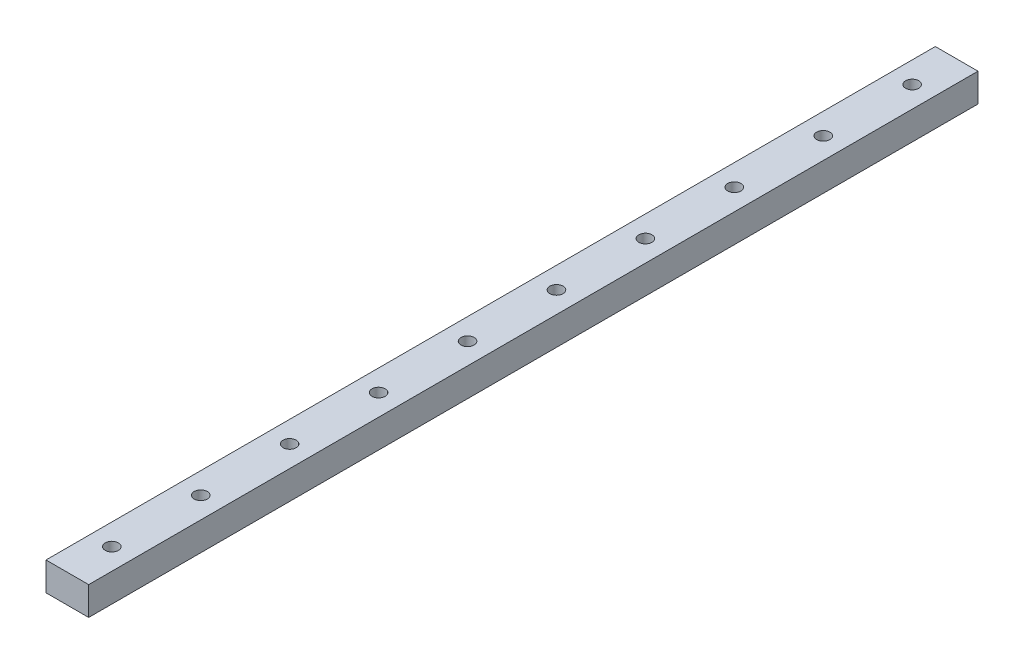
ISO-10303-21;
HEADER;
FILE_DESCRIPTION(('STEP AP214'),'2;1');
FILE_NAME('part.step','',(''),(''),'','','');
FILE_SCHEMA(('AUTOMOTIVE_DESIGN { 1 0 10303 214 1 1 1 1 }'));
ENDSEC;
DATA;
#1=APPLICATION_CONTEXT('core data for automotive mechanical design processes');
#2=APPLICATION_PROTOCOL_DEFINITION('international standard','automotive_design',2000,#1);
#3=PRODUCT_CONTEXT('',#1,'mechanical');
#4=PRODUCT('Part','Part','',(#3));
#5=PRODUCT_RELATED_PRODUCT_CATEGORY('part','',(#4));
#6=PRODUCT_DEFINITION_FORMATION('','',#4);
#7=PRODUCT_DEFINITION_CONTEXT('part definition',#1,'design');
#8=PRODUCT_DEFINITION('design','',#6,#7);
#9=PRODUCT_DEFINITION_SHAPE('','',#8);
#10=(LENGTH_UNIT() NAMED_UNIT(*) SI_UNIT(.MILLI.,.METRE.));
#11=(NAMED_UNIT(*) PLANE_ANGLE_UNIT() SI_UNIT($,.RADIAN.));
#12=(NAMED_UNIT(*) SI_UNIT($,.STERADIAN.) SOLID_ANGLE_UNIT());
#13=UNCERTAINTY_MEASURE_WITH_UNIT(LENGTH_MEASURE(1.E-05),#10,'distance_accuracy_value','');
#14=(GEOMETRIC_REPRESENTATION_CONTEXT(3) GLOBAL_UNCERTAINTY_ASSIGNED_CONTEXT((#13)) GLOBAL_UNIT_ASSIGNED_CONTEXT((#10,
#11,#12)) REPRESENTATION_CONTEXT('',''));
#15=CARTESIAN_POINT('',(0.,0.,0.));
#16=DIRECTION('',(0.,0.,1.));
#17=DIRECTION('',(1.,0.,0.));
#18=AXIS2_PLACEMENT_3D('',#15,#16,#17);
#19=CARTESIAN_POINT('',(6.,0.,12.5));
#20=DIRECTION('',(0.,1.,0.));
#21=DIRECTION('',(0.,0.,1.));
#22=AXIS2_PLACEMENT_3D('',#19,#20,#21);
#23=CYLINDRICAL_SURFACE('',#22,1.85);
#24=CARTESIAN_POINT('',(6.,0.,12.5));
#25=DIRECTION('',(0.,1.,0.));
#26=DIRECTION('',(0.,0.,1.));
#27=AXIS2_PLACEMENT_3D('',#24,#25,#26);
#28=CIRCLE('',#27,1.85);
#29=CARTESIAN_POINT('',(6.,0.,14.35));
#30=VERTEX_POINT('',#29);
#31=EDGE_CURVE('E47',#30,#30,#28,.T.);
#32=ORIENTED_EDGE('',*,*,#31,.F.);
#33=EDGE_LOOP('',(#32));
#34=FACE_BOUND('',#33,.T.);
#35=CARTESIAN_POINT('',(6.,8.,12.5));
#36=DIRECTION('',(0.,1.,0.));
#37=DIRECTION('',(0.,0.,1.));
#38=AXIS2_PLACEMENT_3D('',#35,#36,#37);
#39=CIRCLE('',#38,1.85);
#40=CARTESIAN_POINT('',(6.,8.,14.35));
#41=VERTEX_POINT('',#40);
#42=EDGE_CURVE('E11',#41,#41,#39,.T.);
#43=ORIENTED_EDGE('',*,*,#42,.T.);
#44=EDGE_LOOP('',(#43));
#45=FACE_BOUND('',#44,.T.);
#46=ADVANCED_FACE('F39',(#34,#45),#23,.F.);
#47=CARTESIAN_POINT('',(6.,0.,37.5));
#48=DIRECTION('',(0.,1.,0.));
#49=DIRECTION('',(0.,0.,1.));
#50=AXIS2_PLACEMENT_3D('',#47,#48,#49);
#51=CYLINDRICAL_SURFACE('',#50,1.85);
#52=CARTESIAN_POINT('',(6.,0.,37.5));
#53=DIRECTION('',(0.,1.,0.));
#54=DIRECTION('',(0.,0.,1.));
#55=AXIS2_PLACEMENT_3D('',#52,#53,#54);
#56=CIRCLE('',#55,1.85);
#57=CARTESIAN_POINT('',(6.,0.,39.35));
#58=VERTEX_POINT('',#57);
#59=EDGE_CURVE('E153',#58,#58,#56,.T.);
#60=ORIENTED_EDGE('',*,*,#59,.F.);
#61=EDGE_LOOP('',(#60));
#62=FACE_BOUND('',#61,.T.);
#63=CARTESIAN_POINT('',(6.,8.,37.5));
#64=DIRECTION('',(0.,1.,0.));
#65=DIRECTION('',(0.,0.,1.));
#66=AXIS2_PLACEMENT_3D('',#63,#64,#65);
#67=CIRCLE('',#66,1.85);
#68=CARTESIAN_POINT('',(6.,8.,39.35));
#69=VERTEX_POINT('',#68);
#70=EDGE_CURVE('E156',#69,#69,#67,.T.);
#71=ORIENTED_EDGE('',*,*,#70,.T.);
#72=EDGE_LOOP('',(#71));
#73=FACE_BOUND('',#72,.T.);
#74=ADVANCED_FACE('F164',(#62,#73),#51,.F.);
#75=CARTESIAN_POINT('',(6.,0.,62.5));
#76=DIRECTION('',(0.,1.,0.));
#77=DIRECTION('',(0.,0.,1.));
#78=AXIS2_PLACEMENT_3D('',#75,#76,#77);
#79=CYLINDRICAL_SURFACE('',#78,1.85);
#80=CARTESIAN_POINT('',(6.,0.,62.5));
#81=DIRECTION('',(0.,1.,0.));
#82=DIRECTION('',(0.,0.,1.));
#83=AXIS2_PLACEMENT_3D('',#80,#81,#82);
#84=CIRCLE('',#83,1.85);
#85=CARTESIAN_POINT('',(6.,0.,64.35));
#86=VERTEX_POINT('',#85);
#87=EDGE_CURVE('E147',#86,#86,#84,.T.);
#88=ORIENTED_EDGE('',*,*,#87,.F.);
#89=EDGE_LOOP('',(#88));
#90=FACE_BOUND('',#89,.T.);
#91=CARTESIAN_POINT('',(6.,8.,62.5));
#92=DIRECTION('',(0.,1.,0.));
#93=DIRECTION('',(0.,0.,1.));
#94=AXIS2_PLACEMENT_3D('',#91,#92,#93);
#95=CIRCLE('',#94,1.85);
#96=CARTESIAN_POINT('',(6.,8.,64.35));
#97=VERTEX_POINT('',#96);
#98=EDGE_CURVE('E150',#97,#97,#95,.T.);
#99=ORIENTED_EDGE('',*,*,#98,.T.);
#100=EDGE_LOOP('',(#99));
#101=FACE_BOUND('',#100,.T.);
#102=ADVANCED_FACE('F209',(#90,#101),#79,.F.);
#103=CARTESIAN_POINT('',(6.,0.,87.5));
#104=DIRECTION('',(0.,1.,0.));
#105=DIRECTION('',(0.,0.,1.));
#106=AXIS2_PLACEMENT_3D('',#103,#104,#105);
#107=CYLINDRICAL_SURFACE('',#106,1.85);
#108=CARTESIAN_POINT('',(6.,0.,87.5));
#109=DIRECTION('',(0.,1.,0.));
#110=DIRECTION('',(0.,0.,1.));
#111=AXIS2_PLACEMENT_3D('',#108,#109,#110);
#112=CIRCLE('',#111,1.85);
#113=CARTESIAN_POINT('',(6.,0.,89.35));
#114=VERTEX_POINT('',#113);
#115=EDGE_CURVE('E141',#114,#114,#112,.T.);
#116=ORIENTED_EDGE('',*,*,#115,.F.);
#117=EDGE_LOOP('',(#116));
#118=FACE_BOUND('',#117,.T.);
#119=CARTESIAN_POINT('',(6.,8.,87.5));
#120=DIRECTION('',(0.,1.,0.));
#121=DIRECTION('',(0.,0.,1.));
#122=AXIS2_PLACEMENT_3D('',#119,#120,#121);
#123=CIRCLE('',#122,1.85);
#124=CARTESIAN_POINT('',(6.,8.,89.35));
#125=VERTEX_POINT('',#124);
#126=EDGE_CURVE('E144',#125,#125,#123,.T.);
#127=ORIENTED_EDGE('',*,*,#126,.T.);
#128=EDGE_LOOP('',(#127));
#129=FACE_BOUND('',#128,.T.);
#130=ADVANCED_FACE('F205',(#118,#129),#107,.F.);
#131=CARTESIAN_POINT('',(6.,0.,112.5));
#132=DIRECTION('',(0.,1.,0.));
#133=DIRECTION('',(0.,0.,1.));
#134=AXIS2_PLACEMENT_3D('',#131,#132,#133);
#135=CYLINDRICAL_SURFACE('',#134,1.85);
#136=CARTESIAN_POINT('',(6.,0.,112.5));
#137=DIRECTION('',(0.,1.,0.));
#138=DIRECTION('',(0.,0.,1.));
#139=AXIS2_PLACEMENT_3D('',#136,#137,#138);
#140=CIRCLE('',#139,1.85);
#141=CARTESIAN_POINT('',(6.,0.,114.35));
#142=VERTEX_POINT('',#141);
#143=EDGE_CURVE('E135',#142,#142,#140,.T.);
#144=ORIENTED_EDGE('',*,*,#143,.F.);
#145=EDGE_LOOP('',(#144));
#146=FACE_BOUND('',#145,.T.);
#147=CARTESIAN_POINT('',(6.,8.,112.5));
#148=DIRECTION('',(0.,1.,0.));
#149=DIRECTION('',(0.,0.,1.));
#150=AXIS2_PLACEMENT_3D('',#147,#148,#149);
#151=CIRCLE('',#150,1.85);
#152=CARTESIAN_POINT('',(6.,8.,114.35));
#153=VERTEX_POINT('',#152);
#154=EDGE_CURVE('E138',#153,#153,#151,.T.);
#155=ORIENTED_EDGE('',*,*,#154,.T.);
#156=EDGE_LOOP('',(#155));
#157=FACE_BOUND('',#156,.T.);
#158=ADVANCED_FACE('F201',(#146,#157),#135,.F.);
#159=CARTESIAN_POINT('',(6.,0.,137.5));
#160=DIRECTION('',(0.,1.,0.));
#161=DIRECTION('',(0.,0.,1.));
#162=AXIS2_PLACEMENT_3D('',#159,#160,#161);
#163=CYLINDRICAL_SURFACE('',#162,1.85);
#164=CARTESIAN_POINT('',(6.,0.,137.5));
#165=DIRECTION('',(0.,1.,0.));
#166=DIRECTION('',(0.,0.,1.));
#167=AXIS2_PLACEMENT_3D('',#164,#165,#166);
#168=CIRCLE('',#167,1.85);
#169=CARTESIAN_POINT('',(6.,0.,139.35));
#170=VERTEX_POINT('',#169);
#171=EDGE_CURVE('E129',#170,#170,#168,.T.);
#172=ORIENTED_EDGE('',*,*,#171,.F.);
#173=EDGE_LOOP('',(#172));
#174=FACE_BOUND('',#173,.T.);
#175=CARTESIAN_POINT('',(6.,8.,137.5));
#176=DIRECTION('',(0.,1.,0.));
#177=DIRECTION('',(0.,0.,1.));
#178=AXIS2_PLACEMENT_3D('',#175,#176,#177);
#179=CIRCLE('',#178,1.85);
#180=CARTESIAN_POINT('',(6.,8.,139.35));
#181=VERTEX_POINT('',#180);
#182=EDGE_CURVE('E132',#181,#181,#179,.T.);
#183=ORIENTED_EDGE('',*,*,#182,.T.);
#184=EDGE_LOOP('',(#183));
#185=FACE_BOUND('',#184,.T.);
#186=ADVANCED_FACE('F197',(#174,#185),#163,.F.);
#187=CARTESIAN_POINT('',(6.,0.,162.5));
#188=DIRECTION('',(0.,1.,0.));
#189=DIRECTION('',(0.,0.,1.));
#190=AXIS2_PLACEMENT_3D('',#187,#188,#189);
#191=CYLINDRICAL_SURFACE('',#190,1.85);
#192=CARTESIAN_POINT('',(6.,0.,162.5));
#193=DIRECTION('',(0.,1.,0.));
#194=DIRECTION('',(0.,0.,1.));
#195=AXIS2_PLACEMENT_3D('',#192,#193,#194);
#196=CIRCLE('',#195,1.85);
#197=CARTESIAN_POINT('',(6.,0.,164.35));
#198=VERTEX_POINT('',#197);
#199=EDGE_CURVE('E123',#198,#198,#196,.T.);
#200=ORIENTED_EDGE('',*,*,#199,.F.);
#201=EDGE_LOOP('',(#200));
#202=FACE_BOUND('',#201,.T.);
#203=CARTESIAN_POINT('',(6.,8.,162.5));
#204=DIRECTION('',(0.,1.,0.));
#205=DIRECTION('',(0.,0.,1.));
#206=AXIS2_PLACEMENT_3D('',#203,#204,#205);
#207=CIRCLE('',#206,1.85);
#208=CARTESIAN_POINT('',(6.,8.,164.35));
#209=VERTEX_POINT('',#208);
#210=EDGE_CURVE('E126',#209,#209,#207,.T.);
#211=ORIENTED_EDGE('',*,*,#210,.T.);
#212=EDGE_LOOP('',(#211));
#213=FACE_BOUND('',#212,.T.);
#214=ADVANCED_FACE('F193',(#202,#213),#191,.F.);
#215=CARTESIAN_POINT('',(6.,0.,187.5));
#216=DIRECTION('',(0.,1.,0.));
#217=DIRECTION('',(0.,0.,1.));
#218=AXIS2_PLACEMENT_3D('',#215,#216,#217);
#219=CYLINDRICAL_SURFACE('',#218,1.85);
#220=CARTESIAN_POINT('',(6.,0.,187.5));
#221=DIRECTION('',(0.,1.,0.));
#222=DIRECTION('',(0.,0.,1.));
#223=AXIS2_PLACEMENT_3D('',#220,#221,#222);
#224=CIRCLE('',#223,1.85);
#225=CARTESIAN_POINT('',(6.,0.,189.35));
#226=VERTEX_POINT('',#225);
#227=EDGE_CURVE('E117',#226,#226,#224,.T.);
#228=ORIENTED_EDGE('',*,*,#227,.F.);
#229=EDGE_LOOP('',(#228));
#230=FACE_BOUND('',#229,.T.);
#231=CARTESIAN_POINT('',(6.,8.,187.5));
#232=DIRECTION('',(0.,1.,0.));
#233=DIRECTION('',(0.,0.,1.));
#234=AXIS2_PLACEMENT_3D('',#231,#232,#233);
#235=CIRCLE('',#234,1.85);
#236=CARTESIAN_POINT('',(6.,8.,189.35));
#237=VERTEX_POINT('',#236);
#238=EDGE_CURVE('E120',#237,#237,#235,.T.);
#239=ORIENTED_EDGE('',*,*,#238,.T.);
#240=EDGE_LOOP('',(#239));
#241=FACE_BOUND('',#240,.T.);
#242=ADVANCED_FACE('F189',(#230,#241),#219,.F.);
#243=CARTESIAN_POINT('',(0.,0.,250.));
#244=DIRECTION('',(1.,0.,0.));
#245=DIRECTION('',(0.,0.,-1.));
#246=AXIS2_PLACEMENT_3D('',#243,#244,#245);
#247=PLANE('',#246);
#248=DIRECTION('',(0.,-1.,0.));
#249=VECTOR('',#248,1.);
#250=CARTESIAN_POINT('',(0.,0.,0.));
#251=LINE('',#250,#249);
#252=CARTESIAN_POINT('',(0.,8.,0.));
#253=VERTEX_POINT('',#252);
#254=CARTESIAN_POINT('',(0.,0.,0.));
#255=VERTEX_POINT('',#254);
#256=EDGE_CURVE('E107',#253,#255,#251,.T.);
#257=ORIENTED_EDGE('',*,*,#256,.T.);
#258=DIRECTION('',(0.,0.,-1.));
#259=VECTOR('',#258,1.);
#260=CARTESIAN_POINT('',(0.,0.,250.));
#261=LINE('',#260,#259);
#262=CARTESIAN_POINT('',(0.,0.,250.));
#263=VERTEX_POINT('',#262);
#264=EDGE_CURVE('E98',#263,#255,#261,.T.);
#265=ORIENTED_EDGE('',*,*,#264,.F.);
#266=DIRECTION('',(0.,-1.,0.));
#267=VECTOR('',#266,1.);
#268=CARTESIAN_POINT('',(0.,0.,250.));
#269=LINE('',#268,#267);
#270=CARTESIAN_POINT('',(0.,8.,250.));
#271=VERTEX_POINT('',#270);
#272=EDGE_CURVE('E91',#271,#263,#269,.T.);
#273=ORIENTED_EDGE('',*,*,#272,.F.);
#274=DIRECTION('',(0.,0.,-1.));
#275=VECTOR('',#274,1.);
#276=CARTESIAN_POINT('',(0.,8.,250.));
#277=LINE('',#276,#275);
#278=EDGE_CURVE('E103',#271,#253,#277,.T.);
#279=ORIENTED_EDGE('',*,*,#278,.T.);
#280=EDGE_LOOP('',(#257,#265,#273,#279));
#281=FACE_BOUND('',#280,.T.);
#282=ADVANCED_FACE('F185',(#281),#247,.F.);
#283=CARTESIAN_POINT('',(0.,0.,250.));
#284=DIRECTION('',(0.,1.,0.));
#285=DIRECTION('',(0.,0.,1.));
#286=AXIS2_PLACEMENT_3D('',#283,#284,#285);
#287=PLANE('',#286);
#288=CARTESIAN_POINT('',(6.,0.,212.5));
#289=DIRECTION('',(0.,1.,0.));
#290=DIRECTION('',(0.,0.,1.));
#291=AXIS2_PLACEMENT_3D('',#288,#289,#290);
#292=CIRCLE('',#291,1.85);
#293=CARTESIAN_POINT('',(6.,0.,214.35));
#294=VERTEX_POINT('',#293);
#295=EDGE_CURVE('E324',#294,#294,#292,.T.);
#296=ORIENTED_EDGE('',*,*,#295,.T.);
#297=EDGE_LOOP('',(#296));
#298=FACE_BOUND('',#297,.T.);
#299=CARTESIAN_POINT('',(6.,0.,237.5));
#300=DIRECTION('',(0.,1.,0.));
#301=DIRECTION('',(0.,0.,1.));
#302=AXIS2_PLACEMENT_3D('',#299,#300,#301);
#303=CIRCLE('',#302,1.85);
#304=CARTESIAN_POINT('',(6.,0.,239.35));
#305=VERTEX_POINT('',#304);
#306=EDGE_CURVE('E110',#305,#305,#303,.T.);
#307=ORIENTED_EDGE('',*,*,#306,.T.);
#308=EDGE_LOOP('',(#307));
#309=FACE_BOUND('',#308,.T.);
#310=DIRECTION('',(1.,0.,0.));
#311=VECTOR('',#310,1.);
#312=CARTESIAN_POINT('',(0.,0.,0.));
#313=LINE('',#312,#311);
#314=CARTESIAN_POINT('',(12.,0.,0.));
#315=VERTEX_POINT('',#314);
#316=EDGE_CURVE('E97',#255,#315,#313,.T.);
#317=ORIENTED_EDGE('',*,*,#316,.T.);
#318=DIRECTION('',(0.,0.,-1.));
#319=VECTOR('',#318,1.);
#320=CARTESIAN_POINT('',(12.,0.,250.));
#321=LINE('',#320,#319);
#322=CARTESIAN_POINT('',(12.,0.,250.));
#323=VERTEX_POINT('',#322);
#324=EDGE_CURVE('E94',#323,#315,#321,.T.);
#325=ORIENTED_EDGE('',*,*,#324,.F.);
#326=DIRECTION('',(1.,0.,0.));
#327=VECTOR('',#326,1.);
#328=CARTESIAN_POINT('',(0.,0.,250.));
#329=LINE('',#328,#327);
#330=EDGE_CURVE('E86',#263,#323,#329,.T.);
#331=ORIENTED_EDGE('',*,*,#330,.F.);
#332=ORIENTED_EDGE('',*,*,#264,.T.);
#333=EDGE_LOOP('',(#317,#325,#331,#332));
#334=FACE_BOUND('',#333,.T.);
#335=ORIENTED_EDGE('',*,*,#227,.T.);
#336=EDGE_LOOP('',(#335));
#337=FACE_BOUND('',#336,.T.);
#338=ORIENTED_EDGE('',*,*,#199,.T.);
#339=EDGE_LOOP('',(#338));
#340=FACE_BOUND('',#339,.T.);
#341=ORIENTED_EDGE('',*,*,#171,.T.);
#342=EDGE_LOOP('',(#341));
#343=FACE_BOUND('',#342,.T.);
#344=ORIENTED_EDGE('',*,*,#143,.T.);
#345=EDGE_LOOP('',(#344));
#346=FACE_BOUND('',#345,.T.);
#347=ORIENTED_EDGE('',*,*,#115,.T.);
#348=EDGE_LOOP('',(#347));
#349=FACE_BOUND('',#348,.T.);
#350=ORIENTED_EDGE('',*,*,#87,.T.);
#351=EDGE_LOOP('',(#350));
#352=FACE_BOUND('',#351,.T.);
#353=ORIENTED_EDGE('',*,*,#59,.T.);
#354=EDGE_LOOP('',(#353));
#355=FACE_BOUND('',#354,.T.);
#356=ORIENTED_EDGE('',*,*,#31,.T.);
#357=EDGE_LOOP('',(#356));
#358=FACE_BOUND('',#357,.T.);
#359=ADVANCED_FACE('F95',(#298,#309,#334,#337,#340,#343,#346,#349,#352,#355,#358),#287,.F.);
#360=CARTESIAN_POINT('',(12.,0.,250.));
#361=DIRECTION('',(-1.,0.,0.));
#362=DIRECTION('',(0.,0.,1.));
#363=AXIS2_PLACEMENT_3D('',#360,#361,#362);
#364=PLANE('',#363);
#365=DIRECTION('',(0.,1.,0.));
#366=VECTOR('',#365,1.);
#367=CARTESIAN_POINT('',(12.,0.,0.));
#368=LINE('',#367,#366);
#369=CARTESIAN_POINT('',(12.,8.,0.));
#370=VERTEX_POINT('',#369);
#371=EDGE_CURVE('E72',#315,#370,#368,.T.);
#372=ORIENTED_EDGE('',*,*,#371,.T.);
#373=DIRECTION('',(0.,0.,-1.));
#374=VECTOR('',#373,1.);
#375=CARTESIAN_POINT('',(12.,8.,250.));
#376=LINE('',#375,#374);
#377=CARTESIAN_POINT('',(12.,8.,250.));
#378=VERTEX_POINT('',#377);
#379=EDGE_CURVE('E99',#378,#370,#376,.T.);
#380=ORIENTED_EDGE('',*,*,#379,.F.);
#381=DIRECTION('',(0.,1.,0.));
#382=VECTOR('',#381,1.);
#383=CARTESIAN_POINT('',(12.,0.,250.));
#384=LINE('',#383,#382);
#385=EDGE_CURVE('E89',#323,#378,#384,.T.);
#386=ORIENTED_EDGE('',*,*,#385,.F.);
#387=ORIENTED_EDGE('',*,*,#324,.T.);
#388=EDGE_LOOP('',(#372,#380,#386,#387));
#389=FACE_BOUND('',#388,.T.);
#390=ADVANCED_FACE('F101',(#389),#364,.F.);
#391=CARTESIAN_POINT('',(0.,8.,250.));
#392=DIRECTION('',(0.,-1.,0.));
#393=DIRECTION('',(0.,0.,-1.));
#394=AXIS2_PLACEMENT_3D('',#391,#392,#393);
#395=PLANE('',#394);
#396=CARTESIAN_POINT('',(6.,8.,212.5));
#397=DIRECTION('',(0.,1.,0.));
#398=DIRECTION('',(0.,0.,1.));
#399=AXIS2_PLACEMENT_3D('',#396,#397,#398);
#400=CIRCLE('',#399,1.85);
#401=CARTESIAN_POINT('',(6.,8.,214.35));
#402=VERTEX_POINT('',#401);
#403=EDGE_CURVE('E326',#402,#402,#400,.T.);
#404=ORIENTED_EDGE('',*,*,#403,.F.);
#405=EDGE_LOOP('',(#404));
#406=FACE_BOUND('',#405,.T.);
#407=CARTESIAN_POINT('',(6.,8.,237.5));
#408=DIRECTION('',(0.,1.,0.));
#409=DIRECTION('',(0.,0.,1.));
#410=AXIS2_PLACEMENT_3D('',#407,#408,#409);
#411=CIRCLE('',#410,1.85);
#412=CARTESIAN_POINT('',(6.,8.,239.35));
#413=VERTEX_POINT('',#412);
#414=EDGE_CURVE('E327',#413,#413,#411,.T.);
#415=ORIENTED_EDGE('',*,*,#414,.F.);
#416=EDGE_LOOP('',(#415));
#417=FACE_BOUND('',#416,.T.);
#418=DIRECTION('',(-1.,0.,0.));
#419=VECTOR('',#418,1.);
#420=CARTESIAN_POINT('',(0.,8.,0.));
#421=LINE('',#420,#419);
#422=EDGE_CURVE('E78',#370,#253,#421,.T.);
#423=ORIENTED_EDGE('',*,*,#422,.T.);
#424=ORIENTED_EDGE('',*,*,#278,.F.);
#425=DIRECTION('',(-1.,0.,0.));
#426=VECTOR('',#425,1.);
#427=CARTESIAN_POINT('',(0.,8.,250.));
#428=LINE('',#427,#426);
#429=EDGE_CURVE('E55',#378,#271,#428,.T.);
#430=ORIENTED_EDGE('',*,*,#429,.F.);
#431=ORIENTED_EDGE('',*,*,#379,.T.);
#432=EDGE_LOOP('',(#423,#424,#430,#431));
#433=FACE_BOUND('',#432,.T.);
#434=ORIENTED_EDGE('',*,*,#238,.F.);
#435=EDGE_LOOP('',(#434));
#436=FACE_BOUND('',#435,.T.);
#437=ORIENTED_EDGE('',*,*,#210,.F.);
#438=EDGE_LOOP('',(#437));
#439=FACE_BOUND('',#438,.T.);
#440=ORIENTED_EDGE('',*,*,#182,.F.);
#441=EDGE_LOOP('',(#440));
#442=FACE_BOUND('',#441,.T.);
#443=ORIENTED_EDGE('',*,*,#154,.F.);
#444=EDGE_LOOP('',(#443));
#445=FACE_BOUND('',#444,.T.);
#446=ORIENTED_EDGE('',*,*,#126,.F.);
#447=EDGE_LOOP('',(#446));
#448=FACE_BOUND('',#447,.T.);
#449=ORIENTED_EDGE('',*,*,#98,.F.);
#450=EDGE_LOOP('',(#449));
#451=FACE_BOUND('',#450,.T.);
#452=ORIENTED_EDGE('',*,*,#70,.F.);
#453=EDGE_LOOP('',(#452));
#454=FACE_BOUND('',#453,.T.);
#455=ORIENTED_EDGE('',*,*,#42,.F.);
#456=EDGE_LOOP('',(#455));
#457=FACE_BOUND('',#456,.T.);
#458=ADVANCED_FACE('F167',(#406,#417,#433,#436,#439,#442,#445,#448,#451,#454,#457),#395,.F.);
#459=CARTESIAN_POINT('',(0.,0.,250.));
#460=DIRECTION('',(0.,0.,-1.));
#461=DIRECTION('',(-1.,0.,0.));
#462=AXIS2_PLACEMENT_3D('',#459,#460,#461);
#463=PLANE('',#462);
#464=ORIENTED_EDGE('',*,*,#272,.T.);
#465=ORIENTED_EDGE('',*,*,#330,.T.);
#466=ORIENTED_EDGE('',*,*,#385,.T.);
#467=ORIENTED_EDGE('',*,*,#429,.T.);
#468=EDGE_LOOP('',(#464,#465,#466,#467));
#469=FACE_BOUND('',#468,.T.);
#470=ADVANCED_FACE('F87',(#469),#463,.F.);
#471=CARTESIAN_POINT('',(0.,0.,0.));
#472=DIRECTION('',(0.,0.,-1.));
#473=DIRECTION('',(-1.,0.,0.));
#474=AXIS2_PLACEMENT_3D('',#471,#472,#473);
#475=PLANE('',#474);
#476=ORIENTED_EDGE('',*,*,#256,.F.);
#477=ORIENTED_EDGE('',*,*,#422,.F.);
#478=ORIENTED_EDGE('',*,*,#371,.F.);
#479=ORIENTED_EDGE('',*,*,#316,.F.);
#480=EDGE_LOOP('',(#476,#477,#478,#479));
#481=FACE_BOUND('',#480,.T.);
#482=ADVANCED_FACE('F176',(#481),#475,.T.);
#483=CARTESIAN_POINT('',(6.,0.,237.5));
#484=DIRECTION('',(0.,1.,0.));
#485=DIRECTION('',(0.,0.,1.));
#486=AXIS2_PLACEMENT_3D('',#483,#484,#485);
#487=CYLINDRICAL_SURFACE('',#486,1.85);
#488=ORIENTED_EDGE('',*,*,#306,.F.);
#489=EDGE_LOOP('',(#488));
#490=FACE_BOUND('',#489,.T.);
#491=ORIENTED_EDGE('',*,*,#414,.T.);
#492=EDGE_LOOP('',(#491));
#493=FACE_BOUND('',#492,.T.);
#494=ADVANCED_FACE('F291',(#490,#493),#487,.F.);
#495=CARTESIAN_POINT('',(6.,0.,212.5));
#496=DIRECTION('',(0.,1.,0.));
#497=DIRECTION('',(0.,0.,1.));
#498=AXIS2_PLACEMENT_3D('',#495,#496,#497);
#499=CYLINDRICAL_SURFACE('',#498,1.85);
#500=ORIENTED_EDGE('',*,*,#295,.F.);
#501=EDGE_LOOP('',(#500));
#502=FACE_BOUND('',#501,.T.);
#503=ORIENTED_EDGE('',*,*,#403,.T.);
#504=EDGE_LOOP('',(#503));
#505=FACE_BOUND('',#504,.T.);
#506=ADVANCED_FACE('F298',(#502,#505),#499,.F.);
#507=CLOSED_SHELL('',(#46,#74,#102,#130,#158,#186,#214,#242,#282,#359,#390,#458,#470,#482,#494,#506));
#508=MANIFOLD_SOLID_BREP('B2',#507);
#509=ADVANCED_BREP_SHAPE_REPRESENTATION('',(#18,#508),#14);
#510=SHAPE_DEFINITION_REPRESENTATION(#9,#509);
ENDSEC;
END-ISO-10303-21;
